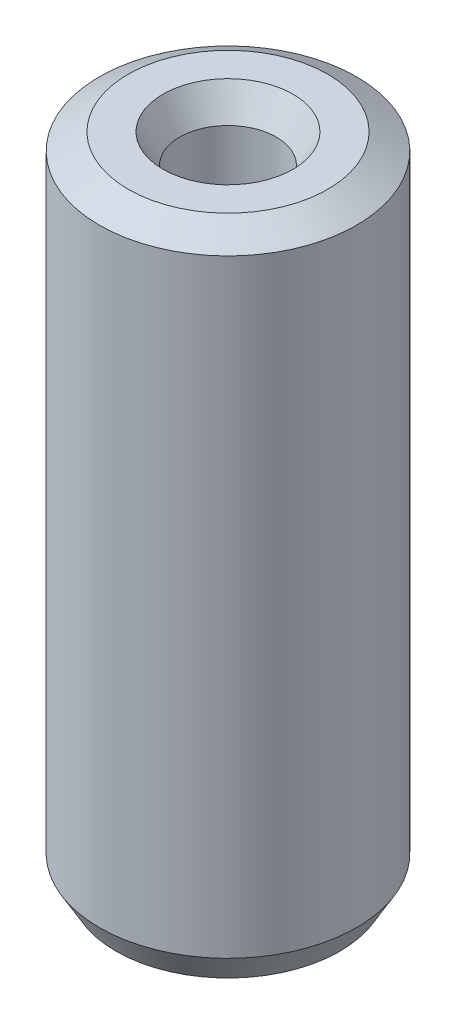
ISO-10303-21;
HEADER;
FILE_DESCRIPTION(('STEP AP214'),'2;1');
FILE_NAME('part.step','',(''),(''),'','','');
FILE_SCHEMA(('AUTOMOTIVE_DESIGN { 1 0 10303 214 1 1 1 1 }'));
ENDSEC;
DATA;
#1=APPLICATION_CONTEXT('core data for automotive mechanical design processes');
#2=APPLICATION_PROTOCOL_DEFINITION('international standard','automotive_design',2000,#1);
#3=PRODUCT_CONTEXT('',#1,'mechanical');
#4=PRODUCT('Part','Part','',(#3));
#5=PRODUCT_RELATED_PRODUCT_CATEGORY('part','',(#4));
#6=PRODUCT_DEFINITION_FORMATION('','',#4);
#7=PRODUCT_DEFINITION_CONTEXT('part definition',#1,'design');
#8=PRODUCT_DEFINITION('design','',#6,#7);
#9=PRODUCT_DEFINITION_SHAPE('','',#8);
#10=(LENGTH_UNIT() NAMED_UNIT(*) SI_UNIT(.MILLI.,.METRE.));
#11=(NAMED_UNIT(*) PLANE_ANGLE_UNIT() SI_UNIT($,.RADIAN.));
#12=(NAMED_UNIT(*) SI_UNIT($,.STERADIAN.) SOLID_ANGLE_UNIT());
#13=UNCERTAINTY_MEASURE_WITH_UNIT(LENGTH_MEASURE(1.E-05),#10,'distance_accuracy_value','');
#14=(GEOMETRIC_REPRESENTATION_CONTEXT(3) GLOBAL_UNCERTAINTY_ASSIGNED_CONTEXT((#13)) GLOBAL_UNIT_ASSIGNED_CONTEXT((#10,
#11,#12)) REPRESENTATION_CONTEXT('',''));
#15=CARTESIAN_POINT('',(0.,0.,0.));
#16=DIRECTION('',(0.,0.,1.));
#17=DIRECTION('',(1.,0.,0.));
#18=AXIS2_PLACEMENT_3D('',#15,#16,#17);
#19=CARTESIAN_POINT('',(0.,152.530745351742,0.));
#20=DIRECTION('',(0.,-1.,0.));
#21=DIRECTION('',(0.,0.,-1.));
#22=AXIS2_PLACEMENT_3D('',#19,#20,#21);
#23=CYLINDRICAL_SURFACE('',#22,30.);
#24=CARTESIAN_POINT('',(0.,6.72712389735147,0.));
#25=DIRECTION('',(0.,1.,0.));
#26=DIRECTION('',(0.,0.,1.));
#27=AXIS2_PLACEMENT_3D('',#24,#25,#26);
#28=CIRCLE('',#27,30.);
#29=CARTESIAN_POINT('',(0.,6.72712389735147,30.));
#30=VERTEX_POINT('',#29);
#31=EDGE_CURVE('E10',#30,#30,#28,.T.);
#32=ORIENTED_EDGE('',*,*,#31,.T.);
#33=EDGE_LOOP('',(#32));
#34=FACE_BOUND('',#33,.T.);
#35=CARTESIAN_POINT('',(0.,148.646838558734,0.));
#36=DIRECTION('',(0.,1.,0.));
#37=DIRECTION('',(0.,0.,1.));
#38=AXIS2_PLACEMENT_3D('',#35,#36,#37);
#39=CIRCLE('',#38,30.);
#40=CARTESIAN_POINT('',(0.,148.646838558734,30.));
#41=VERTEX_POINT('',#40);
#42=EDGE_CURVE('E50',#41,#41,#39,.F.);
#43=ORIENTED_EDGE('',*,*,#42,.T.);
#44=EDGE_LOOP('',(#43));
#45=FACE_BOUND('',#44,.T.);
#46=ADVANCED_FACE('F39',(#34,#45),#23,.T.);
#47=CARTESIAN_POINT('',(0.,152.530745351742,0.));
#48=DIRECTION('',(0.,1.,0.));
#49=DIRECTION('',(0.,0.,1.));
#50=AXIS2_PLACEMENT_3D('',#47,#48,#49);
#51=PLANE('',#50);
#52=CARTESIAN_POINT('',(0.,152.530745351742,0.));
#53=DIRECTION('',(0.,1.,0.));
#54=DIRECTION('',(0.,0.,1.));
#55=AXIS2_PLACEMENT_3D('',#52,#53,#54);
#56=CIRCLE('',#55,15.1779490653679);
#57=CARTESIAN_POINT('',(0.,152.530745351742,15.1779490653679));
#58=VERTEX_POINT('',#57);
#59=EDGE_CURVE('E58',#58,#58,#56,.F.);
#60=ORIENTED_EDGE('',*,*,#59,.T.);
#61=EDGE_LOOP('',(#60));
#62=FACE_BOUND('',#61,.T.);
#63=CARTESIAN_POINT('',(0.,152.530745351742,0.));
#64=DIRECTION('',(0.,1.,0.));
#65=DIRECTION('',(0.,0.,1.));
#66=AXIS2_PLACEMENT_3D('',#63,#64,#65);
#67=CIRCLE('',#66,23.2728761026485);
#68=CARTESIAN_POINT('',(0.,152.530745351742,23.2728761026485));
#69=VERTEX_POINT('',#68);
#70=EDGE_CURVE('E61',#69,#69,#67,.T.);
#71=ORIENTED_EDGE('',*,*,#70,.T.);
#72=EDGE_LOOP('',(#71));
#73=FACE_BOUND('',#72,.T.);
#74=ADVANCED_FACE('F88',(#62,#73),#51,.T.);
#75=CARTESIAN_POINT('',(0.,0.,0.));
#76=DIRECTION('',(0.,1.,0.));
#77=DIRECTION('',(0.,0.,1.));
#78=AXIS2_PLACEMENT_3D('',#75,#76,#77);
#79=PLANE('',#78);
#80=CARTESIAN_POINT('',(0.,0.,0.));
#81=DIRECTION('',(0.,1.,0.));
#82=DIRECTION('',(0.,0.,1.));
#83=AXIS2_PLACEMENT_3D('',#80,#81,#82);
#84=CIRCLE('',#83,18.0211661697116);
#85=CARTESIAN_POINT('',(0.,0.,18.0211661697116));
#86=VERTEX_POINT('',#85);
#87=EDGE_CURVE('E51',#86,#86,#84,.T.);
#88=ORIENTED_EDGE('',*,*,#87,.T.);
#89=EDGE_LOOP('',(#88));
#90=FACE_BOUND('',#89,.T.);
#91=CARTESIAN_POINT('',(0.,0.,0.));
#92=DIRECTION('',(0.,1.,0.));
#93=DIRECTION('',(0.,0.,1.));
#94=AXIS2_PLACEMENT_3D('',#91,#92,#93);
#95=CIRCLE('',#94,26.1160932069921);
#96=CARTESIAN_POINT('',(0.,0.,26.1160932069921));
#97=VERTEX_POINT('',#96);
#98=EDGE_CURVE('E54',#97,#97,#95,.F.);
#99=ORIENTED_EDGE('',*,*,#98,.T.);
#100=EDGE_LOOP('',(#99));
#101=FACE_BOUND('',#100,.T.);
#102=ADVANCED_FACE('F83',(#90,#101),#79,.F.);
#103=CARTESIAN_POINT('',(0.,152.530745351742,0.));
#104=DIRECTION('',(0.,-1.,0.));
#105=DIRECTION('',(0.,0.,-1.));
#106=AXIS2_PLACEMENT_3D('',#103,#104,#105);
#107=CYLINDRICAL_SURFACE('',#106,11.2940422723601);
#108=CARTESIAN_POINT('',(0.,145.80362145439,0.));
#109=DIRECTION('',(0.,1.,0.));
#110=DIRECTION('',(0.,0.,1.));
#111=AXIS2_PLACEMENT_3D('',#108,#109,#110);
#112=CIRCLE('',#111,11.2940422723601);
#113=CARTESIAN_POINT('',(0.,145.80362145439,11.29404227236));
#114=VERTEX_POINT('',#113);
#115=EDGE_CURVE('E67',#114,#114,#112,.T.);
#116=ORIENTED_EDGE('',*,*,#115,.T.);
#117=EDGE_LOOP('',(#116));
#118=FACE_BOUND('',#117,.T.);
#119=CARTESIAN_POINT('',(0.,3.88390679300787,0.));
#120=DIRECTION('',(0.,1.,0.));
#121=DIRECTION('',(0.,0.,1.));
#122=AXIS2_PLACEMENT_3D('',#119,#120,#121);
#123=CIRCLE('',#122,11.2940422723601);
#124=CARTESIAN_POINT('',(0.,3.88390679300787,11.2940422723601));
#125=VERTEX_POINT('',#124);
#126=EDGE_CURVE('E69',#125,#125,#123,.F.);
#127=ORIENTED_EDGE('',*,*,#126,.T.);
#128=EDGE_LOOP('',(#127));
#129=FACE_BOUND('',#128,.T.);
#130=ADVANCED_FACE('F71',(#118,#129),#107,.F.);
#131=CARTESIAN_POINT('',(0.,145.80362145439,0.));
#132=DIRECTION('',(0.,1.,0.));
#133=DIRECTION('',(0.,0.,1.));
#134=AXIS2_PLACEMENT_3D('',#131,#132,#133);
#135=CONICAL_SURFACE('',#134,11.2940422723601,0.523598775598299);
#136=CARTESIAN_POINT('',(0.,152.530745351742,15.1779490653679));
#137=CARTESIAN_POINT('',(0.,152.460671144478,15.1374917029408));
#138=CARTESIAN_POINT('',(0.,152.390596937214,15.0970343405136));
#139=CARTESIAN_POINT('',(0.,152.250448522686,15.0161196156593));
#140=CARTESIAN_POINT('',(0.,152.180374315422,14.9756622532321));
#141=CARTESIAN_POINT('',(0.,152.040225900893,14.8947475283778));
#142=CARTESIAN_POINT('',(0.,151.970151693629,14.8542901659506));
#143=CARTESIAN_POINT('',(0.,151.830003279101,14.7733754410963));
#144=CARTESIAN_POINT('',(0.,151.759929071837,14.7329180786691));
#145=CARTESIAN_POINT('',(0.,151.619780657309,14.6520033538148));
#146=CARTESIAN_POINT('',(0.,151.549706450045,14.6115459913876));
#147=CARTESIAN_POINT('',(0.,151.409558035517,14.5306312665333));
#148=CARTESIAN_POINT('',(0.,151.339483828253,14.4901739041061));
#149=CARTESIAN_POINT('',(0.,151.199335413725,14.4092591792518));
#150=CARTESIAN_POINT('',(0.,151.12926120646,14.3688018168246));
#151=CARTESIAN_POINT('',(0.,150.989112791932,14.2878870919703));
#152=CARTESIAN_POINT('',(0.,150.919038584668,14.2474297295431));
#153=CARTESIAN_POINT('',(0.,150.77889017014,14.1665150046888));
#154=CARTESIAN_POINT('',(0.,150.708815962876,14.1260576422616));
#155=CARTESIAN_POINT('',(0.,150.568667548348,14.0451429174073));
#156=CARTESIAN_POINT('',(0.,150.498593341084,14.0046855549801));
#157=CARTESIAN_POINT('',(0.,150.358444926556,13.9237708301258));
#158=CARTESIAN_POINT('',(0.,150.288370719292,13.8833134676986));
#159=CARTESIAN_POINT('',(0.,150.148222304763,13.8023987428443));
#160=CARTESIAN_POINT('',(0.,150.078148097499,13.7619413804171));
#161=CARTESIAN_POINT('',(0.,149.937999682971,13.6810266555628));
#162=CARTESIAN_POINT('',(0.,149.867925475707,13.6405692931356));
#163=CARTESIAN_POINT('',(0.,149.727777061179,13.5596545682813));
#164=CARTESIAN_POINT('',(0.,149.657702853915,13.5191972058541));
#165=CARTESIAN_POINT('',(0.,149.517554439387,13.4382824809998));
#166=CARTESIAN_POINT('',(0.,149.447480232123,13.3978251185727));
#167=CARTESIAN_POINT('',(0.,149.307331817594,13.3169103937183));
#168=CARTESIAN_POINT('',(0.,149.23725761033,13.2764530312912));
#169=CARTESIAN_POINT('',(0.,149.097109195802,13.1955383064368));
#170=CARTESIAN_POINT('',(0.,149.027034988538,13.1550809440097));
#171=CARTESIAN_POINT('',(0.,148.88688657401,13.0741662191553));
#172=CARTESIAN_POINT('',(0.,148.816812366746,13.0337088567282));
#173=CARTESIAN_POINT('',(0.,148.676663952218,12.9527941318738));
#174=CARTESIAN_POINT('',(0.,148.606589744954,12.9123367694467));
#175=CARTESIAN_POINT('',(0.,148.466441330425,12.8314220445923));
#176=CARTESIAN_POINT('',(0.,148.396367123161,12.7909646821652));
#177=CARTESIAN_POINT('',(0.,148.256218708633,12.7100499573108));
#178=CARTESIAN_POINT('',(0.,148.186144501369,12.6695925948837));
#179=CARTESIAN_POINT('',(0.,148.045996086841,12.5886778700293));
#180=CARTESIAN_POINT('',(0.,147.975921879577,12.5482205076022));
#181=CARTESIAN_POINT('',(0.,147.835773465049,12.4673057827478));
#182=CARTESIAN_POINT('',(0.,147.765699257785,12.4268484203207));
#183=CARTESIAN_POINT('',(0.,147.625550843257,12.3459336954663));
#184=CARTESIAN_POINT('',(0.,147.555476635992,12.3054763330392));
#185=CARTESIAN_POINT('',(0.,147.415328221464,12.2245616081849));
#186=CARTESIAN_POINT('',(0.,147.3452540142,12.1841042457577));
#187=CARTESIAN_POINT('',(0.,147.205105599672,12.1031895209034));
#188=CARTESIAN_POINT('',(0.,147.135031392408,12.0627321584762));
#189=CARTESIAN_POINT('',(0.,146.99488297788,11.9818174336219));
#190=CARTESIAN_POINT('',(0.,146.924808770616,11.9413600711947));
#191=CARTESIAN_POINT('',(0.,146.784660356088,11.8604453463404));
#192=CARTESIAN_POINT('',(0.,146.714586148823,11.8199879839132));
#193=CARTESIAN_POINT('',(0.,146.574437734295,11.7390732590589));
#194=CARTESIAN_POINT('',(0.,146.504363527031,11.6986158966317));
#195=CARTESIAN_POINT('',(0.,146.364215112503,11.6177011717774));
#196=CARTESIAN_POINT('',(0.,146.294140905239,11.5772438093502));
#197=CARTESIAN_POINT('',(0.,146.153992490711,11.4963290844959));
#198=CARTESIAN_POINT('',(0.,146.083918283447,11.4558717220687));
#199=CARTESIAN_POINT('',(0.,145.943769868919,11.3749569972144));
#200=CARTESIAN_POINT('',(0.,145.873695661655,11.3344996347872));
#201=CARTESIAN_POINT('',(0.,145.80362145439,11.29404227236));
#202=B_SPLINE_CURVE_WITH_KNOTS('',3,(#136,#137,#138,#139,#140,#141,#142,#143,#144,#145,#146,
#147,#148,#149,#150,#151,#152,#153,#154,#155,#156,#157,#158,#159,#160,#161,#162,#163,#164,#165,
#166,#167,#168,#169,#170,#171,#172,#173,#174,#175,#176,#177,#178,#179,#180,#181,#182,#183,#184,
#185,#186,#187,#188,#189,#190,#191,#192,#193,#194,#195,#196,#197,#198,#199,#200,#201),
.UNSPECIFIED.,.F.,.F.,(4,2,2,2,2,2,2,2,2,2,2,2,2,2,2,2,2,2,2,2,2,2,2,2,2,2,2,2,2,2,2,2,4),(0.,
0.242744174562972,0.485488349125967,0.728232523688961,0.970976698251957,1.21372087281495,
1.45646504737795,1.69920922194094,1.94195339650394,2.18469757106693,2.42744174562993,
2.6701859201929,2.91293009475589,3.15567426931889,3.39841844388188,3.64116261844488,
3.88390679300787,4.12665096757087,4.36939514213386,4.61213931669686,4.85488349125985,
5.09762766582285,5.34037184038582,5.58311601494882,5.82586018951181,6.0686043640748,
6.3113485386378,6.55409271320079,6.79683688776379,7.03958106232678,7.28232523688978,
7.52506941145277,7.76781358601575),.UNSPECIFIED.);
#203=EDGE_CURVE('BSEAM77',#58,#114,#202,.T.);
#204=ORIENTED_EDGE('',*,*,#59,.F.);
#205=ORIENTED_EDGE('',*,*,#115,.F.);
#206=ORIENTED_EDGE('',*,*,#203,.T.);
#207=ORIENTED_EDGE('',*,*,#203,.F.);
#208=EDGE_LOOP('',(#204,#206,#205,#207));
#209=FACE_BOUND('',#208,.T.);
#210=ADVANCED_FACE('F77',(#209),#135,.F.);
#211=CARTESIAN_POINT('',(0.,0.,0.));
#212=DIRECTION('',(0.,-1.,0.));
#213=DIRECTION('',(0.,0.,-1.));
#214=AXIS2_PLACEMENT_3D('',#211,#212,#213);
#215=CONICAL_SURFACE('',#214,18.0211661697116,1.0471975511966);
#216=ORIENTED_EDGE('',*,*,#126,.F.);
#217=EDGE_LOOP('',(#216));
#218=FACE_BOUND('',#217,.T.);
#219=ORIENTED_EDGE('',*,*,#87,.F.);
#220=EDGE_LOOP('',(#219));
#221=FACE_BOUND('',#220,.T.);
#222=ADVANCED_FACE('F73',(#218,#221),#215,.F.);
#223=CARTESIAN_POINT('',(0.,6.72712389735147,0.));
#224=DIRECTION('',(0.,1.,0.));
#225=DIRECTION('',(0.,0.,1.));
#226=AXIS2_PLACEMENT_3D('',#223,#224,#225);
#227=CONICAL_SURFACE('',#226,30.,0.523598775598304);
#228=ORIENTED_EDGE('',*,*,#98,.F.);
#229=EDGE_LOOP('',(#228));
#230=FACE_BOUND('',#229,.T.);
#231=ORIENTED_EDGE('',*,*,#31,.F.);
#232=EDGE_LOOP('',(#231));
#233=FACE_BOUND('',#232,.T.);
#234=ADVANCED_FACE('F76',(#230,#233),#227,.T.);
#235=CARTESIAN_POINT('',(0.,152.530745351742,0.));
#236=DIRECTION('',(0.,-1.,0.));
#237=DIRECTION('',(0.,0.,-1.));
#238=AXIS2_PLACEMENT_3D('',#235,#236,#237);
#239=CONICAL_SURFACE('',#238,23.2728761026485,1.0471975511966);
#240=ORIENTED_EDGE('',*,*,#42,.F.);
#241=EDGE_LOOP('',(#240));
#242=FACE_BOUND('',#241,.T.);
#243=ORIENTED_EDGE('',*,*,#70,.F.);
#244=EDGE_LOOP('',(#243));
#245=FACE_BOUND('',#244,.T.);
#246=ADVANCED_FACE('F45',(#242,#245),#239,.T.);
#247=CLOSED_SHELL('',(#46,#74,#102,#130,#210,#222,#234,#246));
#248=MANIFOLD_SOLID_BREP('B2',#247);
#249=ADVANCED_BREP_SHAPE_REPRESENTATION('',(#18,#248),#14);
#250=SHAPE_DEFINITION_REPRESENTATION(#9,#249);
ENDSEC;
END-ISO-10303-21;
